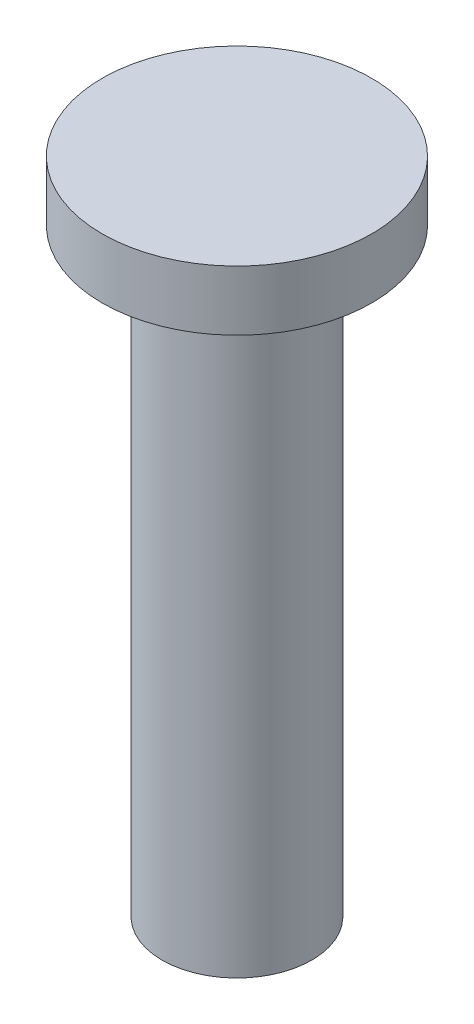
ISO-10303-21;
HEADER;
FILE_DESCRIPTION(('STEP AP214'),'2;1');
FILE_NAME('part.step','',(''),(''),'','','');
FILE_SCHEMA(('AUTOMOTIVE_DESIGN { 1 0 10303 214 1 1 1 1 }'));
ENDSEC;
DATA;
#1=APPLICATION_CONTEXT('core data for automotive mechanical design processes');
#2=APPLICATION_PROTOCOL_DEFINITION('international standard','automotive_design',2000,#1);
#3=PRODUCT_CONTEXT('',#1,'mechanical');
#4=PRODUCT('Part','Part','',(#3));
#5=PRODUCT_RELATED_PRODUCT_CATEGORY('part','',(#4));
#6=PRODUCT_DEFINITION_FORMATION('','',#4);
#7=PRODUCT_DEFINITION_CONTEXT('part definition',#1,'design');
#8=PRODUCT_DEFINITION('design','',#6,#7);
#9=PRODUCT_DEFINITION_SHAPE('','',#8);
#10=(LENGTH_UNIT() NAMED_UNIT(*) SI_UNIT(.MILLI.,.METRE.));
#11=(NAMED_UNIT(*) PLANE_ANGLE_UNIT() SI_UNIT($,.RADIAN.));
#12=(NAMED_UNIT(*) SI_UNIT($,.STERADIAN.) SOLID_ANGLE_UNIT());
#13=UNCERTAINTY_MEASURE_WITH_UNIT(LENGTH_MEASURE(1.E-05),#10,'distance_accuracy_value','');
#14=(GEOMETRIC_REPRESENTATION_CONTEXT(3) GLOBAL_UNCERTAINTY_ASSIGNED_CONTEXT((#13)) GLOBAL_UNIT_ASSIGNED_CONTEXT((#10,
#11,#12)) REPRESENTATION_CONTEXT('',''));
#15=CARTESIAN_POINT('',(0.,0.,0.));
#16=DIRECTION('',(0.,0.,1.));
#17=DIRECTION('',(1.,0.,0.));
#18=AXIS2_PLACEMENT_3D('',#15,#16,#17);
#19=CARTESIAN_POINT('',(0.,20.,0.));
#20=DIRECTION('',(0.,-1.,0.));
#21=DIRECTION('',(0.,0.,-1.));
#22=AXIS2_PLACEMENT_3D('',#19,#20,#21);
#23=CYLINDRICAL_SURFACE('',#22,2.5);
#24=CARTESIAN_POINT('',(0.,20.,0.));
#25=DIRECTION('',(0.,1.,0.));
#26=DIRECTION('',(0.,0.,1.));
#27=AXIS2_PLACEMENT_3D('',#24,#25,#26);
#28=CIRCLE('',#27,2.5);
#29=CARTESIAN_POINT('',(0.,20.,2.5));
#30=VERTEX_POINT('',#29);
#31=EDGE_CURVE('E10',#30,#30,#28,.T.);
#32=ORIENTED_EDGE('',*,*,#31,.F.);
#33=EDGE_LOOP('',(#32));
#34=FACE_BOUND('',#33,.T.);
#35=CARTESIAN_POINT('',(0.,0.,0.));
#36=DIRECTION('',(0.,1.,0.));
#37=DIRECTION('',(0.,0.,1.));
#38=AXIS2_PLACEMENT_3D('',#35,#36,#37);
#39=CIRCLE('',#38,2.5);
#40=CARTESIAN_POINT('',(0.,0.,2.5));
#41=VERTEX_POINT('',#40);
#42=EDGE_CURVE('E38',#41,#41,#39,.T.);
#43=ORIENTED_EDGE('',*,*,#42,.T.);
#44=EDGE_LOOP('',(#43));
#45=FACE_BOUND('',#44,.T.);
#46=ADVANCED_FACE('F35',(#34,#45),#23,.T.);
#47=CARTESIAN_POINT('',(0.,0.,0.));
#48=DIRECTION('',(0.,1.,0.));
#49=DIRECTION('',(0.,0.,1.));
#50=AXIS2_PLACEMENT_3D('',#47,#48,#49);
#51=PLANE('',#50);
#52=ORIENTED_EDGE('',*,*,#42,.F.);
#53=EDGE_LOOP('',(#52));
#54=FACE_BOUND('',#53,.T.);
#55=ADVANCED_FACE('F58',(#54),#51,.F.);
#56=CARTESIAN_POINT('',(0.,22.,0.));
#57=DIRECTION('',(0.,-1.,0.));
#58=DIRECTION('',(0.,0.,-1.));
#59=AXIS2_PLACEMENT_3D('',#56,#57,#58);
#60=CYLINDRICAL_SURFACE('',#59,4.5);
#61=CARTESIAN_POINT('',(0.,22.,0.));
#62=DIRECTION('',(0.,1.,0.));
#63=DIRECTION('',(0.,0.,1.));
#64=AXIS2_PLACEMENT_3D('',#61,#62,#63);
#65=CIRCLE('',#64,4.5);
#66=CARTESIAN_POINT('',(0.,22.,4.5));
#67=VERTEX_POINT('',#66);
#68=EDGE_CURVE('E45',#67,#67,#65,.T.);
#69=ORIENTED_EDGE('',*,*,#68,.F.);
#70=EDGE_LOOP('',(#69));
#71=FACE_BOUND('',#70,.T.);
#72=CARTESIAN_POINT('',(0.,20.,0.));
#73=DIRECTION('',(0.,1.,0.));
#74=DIRECTION('',(0.,0.,1.));
#75=AXIS2_PLACEMENT_3D('',#72,#73,#74);
#76=CIRCLE('',#75,4.5);
#77=CARTESIAN_POINT('',(0.,20.,4.5));
#78=VERTEX_POINT('',#77);
#79=EDGE_CURVE('E47',#78,#78,#76,.T.);
#80=ORIENTED_EDGE('',*,*,#79,.T.);
#81=EDGE_LOOP('',(#80));
#82=FACE_BOUND('',#81,.T.);
#83=ADVANCED_FACE('F55',(#71,#82),#60,.T.);
#84=CARTESIAN_POINT('',(0.,22.,0.));
#85=DIRECTION('',(0.,1.,0.));
#86=DIRECTION('',(0.,0.,1.));
#87=AXIS2_PLACEMENT_3D('',#84,#85,#86);
#88=PLANE('',#87);
#89=ORIENTED_EDGE('',*,*,#68,.T.);
#90=EDGE_LOOP('',(#89));
#91=FACE_BOUND('',#90,.T.);
#92=ADVANCED_FACE('F53',(#91),#88,.T.);
#93=CARTESIAN_POINT('',(0.,20.,0.));
#94=DIRECTION('',(0.,1.,0.));
#95=DIRECTION('',(0.,0.,1.));
#96=AXIS2_PLACEMENT_3D('',#93,#94,#95);
#97=PLANE('',#96);
#98=ORIENTED_EDGE('',*,*,#31,.T.);
#99=EDGE_LOOP('',(#98));
#100=FACE_BOUND('',#99,.T.);
#101=ORIENTED_EDGE('',*,*,#79,.F.);
#102=EDGE_LOOP('',(#101));
#103=FACE_BOUND('',#102,.T.);
#104=ADVANCED_FACE('F62',(#100,#103),#97,.F.);
#105=CLOSED_SHELL('',(#46,#55,#83,#92,#104));
#106=MANIFOLD_SOLID_BREP('B2',#105);
#107=ADVANCED_BREP_SHAPE_REPRESENTATION('',(#18,#106),#14);
#108=SHAPE_DEFINITION_REPRESENTATION(#9,#107);
ENDSEC;
END-ISO-10303-21;
